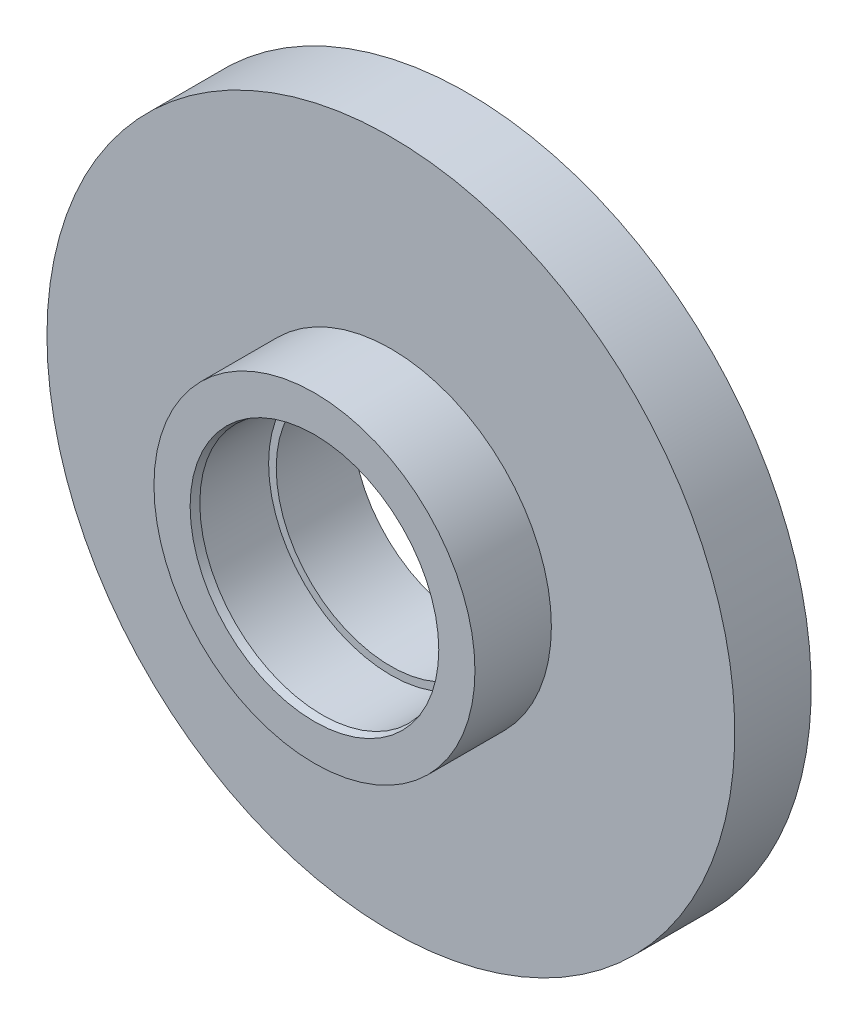
ISO-10303-21;
HEADER;
FILE_DESCRIPTION(('STEP AP214'),'2;1');
FILE_NAME('part.step','',(''),(''),'','','');
FILE_SCHEMA(('AUTOMOTIVE_DESIGN { 1 0 10303 214 1 1 1 1 }'));
ENDSEC;
DATA;
#1=APPLICATION_CONTEXT('core data for automotive mechanical design processes');
#2=APPLICATION_PROTOCOL_DEFINITION('international standard','automotive_design',2000,#1);
#3=PRODUCT_CONTEXT('',#1,'mechanical');
#4=PRODUCT('Part','Part','',(#3));
#5=PRODUCT_RELATED_PRODUCT_CATEGORY('part','',(#4));
#6=PRODUCT_DEFINITION_FORMATION('','',#4);
#7=PRODUCT_DEFINITION_CONTEXT('part definition',#1,'design');
#8=PRODUCT_DEFINITION('design','',#6,#7);
#9=PRODUCT_DEFINITION_SHAPE('','',#8);
#10=(LENGTH_UNIT() NAMED_UNIT(*) SI_UNIT(.MILLI.,.METRE.));
#11=(NAMED_UNIT(*) PLANE_ANGLE_UNIT() SI_UNIT($,.RADIAN.));
#12=(NAMED_UNIT(*) SI_UNIT($,.STERADIAN.) SOLID_ANGLE_UNIT());
#13=UNCERTAINTY_MEASURE_WITH_UNIT(LENGTH_MEASURE(1.E-05),#10,'distance_accuracy_value','');
#14=(GEOMETRIC_REPRESENTATION_CONTEXT(3) GLOBAL_UNCERTAINTY_ASSIGNED_CONTEXT((#13)) GLOBAL_UNIT_ASSIGNED_CONTEXT((#10,
#11,#12)) REPRESENTATION_CONTEXT('',''));
#15=CARTESIAN_POINT('',(0.,0.,0.));
#16=DIRECTION('',(0.,0.,1.));
#17=DIRECTION('',(1.,0.,0.));
#18=AXIS2_PLACEMENT_3D('',#15,#16,#17);
#19=CARTESIAN_POINT('',(16.,0.,0.));
#20=DIRECTION('',(0.,0.,-1.));
#21=DIRECTION('',(-1.,0.,0.));
#22=AXIS2_PLACEMENT_3D('',#19,#20,#21);
#23=PLANE('',#22);
#24=CARTESIAN_POINT('',(0.,0.,0.));
#25=DIRECTION('',(0.,0.,-1.));
#26=DIRECTION('',(-1.,0.,0.));
#27=AXIS2_PLACEMENT_3D('',#24,#25,#26);
#28=CIRCLE('',#27,16.2679491924312);
#29=CARTESIAN_POINT('',(-16.2679491924312,0.,0.));
#30=VERTEX_POINT('',#29);
#31=EDGE_CURVE('E37',#30,#30,#28,.T.);
#32=ORIENTED_EDGE('',*,*,#31,.T.);
#33=EDGE_LOOP('',(#32));
#34=FACE_BOUND('',#33,.T.);
#35=CARTESIAN_POINT('',(0.,0.,0.));
#36=DIRECTION('',(0.,0.,-1.));
#37=DIRECTION('',(-1.,0.,0.));
#38=AXIS2_PLACEMENT_3D('',#35,#36,#37);
#39=CIRCLE('',#38,21.);
#40=CARTESIAN_POINT('',(-21.,0.,0.));
#41=VERTEX_POINT('',#40);
#42=EDGE_CURVE('E41',#41,#41,#39,.T.);
#43=ORIENTED_EDGE('',*,*,#42,.F.);
#44=EDGE_LOOP('',(#43));
#45=FACE_BOUND('',#44,.T.);
#46=ADVANCED_FACE('F30',(#34,#45),#23,.F.);
#47=CARTESIAN_POINT('',(0.,0.,0.));
#48=DIRECTION('',(0.,0.,-1.));
#49=DIRECTION('',(-1.,0.,0.));
#50=AXIS2_PLACEMENT_3D('',#47,#48,#49);
#51=CYLINDRICAL_SURFACE('',#50,21.);
#52=CARTESIAN_POINT('',(0.,0.,-10.));
#53=DIRECTION('',(0.,0.,-1.));
#54=DIRECTION('',(-1.,0.,0.));
#55=AXIS2_PLACEMENT_3D('',#52,#53,#54);
#56=CIRCLE('',#55,21.);
#57=CARTESIAN_POINT('',(-21.,0.,-10.));
#58=VERTEX_POINT('',#57);
#59=EDGE_CURVE('E45',#58,#58,#56,.T.);
#60=ORIENTED_EDGE('',*,*,#59,.F.);
#61=EDGE_LOOP('',(#60));
#62=FACE_BOUND('',#61,.T.);
#63=ORIENTED_EDGE('',*,*,#42,.T.);
#64=EDGE_LOOP('',(#63));
#65=FACE_BOUND('',#64,.T.);
#66=ADVANCED_FACE('F95',(#62,#65),#51,.T.);
#67=CARTESIAN_POINT('',(21.,0.,-10.));
#68=DIRECTION('',(0.,0.,-1.));
#69=DIRECTION('',(-1.,0.,0.));
#70=AXIS2_PLACEMENT_3D('',#67,#68,#69);
#71=PLANE('',#70);
#72=CARTESIAN_POINT('',(0.,0.,-10.));
#73=DIRECTION('',(0.,0.,-1.));
#74=DIRECTION('',(-1.,0.,0.));
#75=AXIS2_PLACEMENT_3D('',#72,#73,#74);
#76=CIRCLE('',#75,45.);
#77=CARTESIAN_POINT('',(-45.,0.,-10.));
#78=VERTEX_POINT('',#77);
#79=EDGE_CURVE('E50',#78,#78,#76,.T.);
#80=ORIENTED_EDGE('',*,*,#79,.F.);
#81=EDGE_LOOP('',(#80));
#82=FACE_BOUND('',#81,.T.);
#83=ORIENTED_EDGE('',*,*,#59,.T.);
#84=EDGE_LOOP('',(#83));
#85=FACE_BOUND('',#84,.T.);
#86=ADVANCED_FACE('F89',(#82,#85),#71,.F.);
#87=CARTESIAN_POINT('',(0.,0.,0.));
#88=DIRECTION('',(0.,0.,-1.));
#89=DIRECTION('',(-1.,0.,0.));
#90=AXIS2_PLACEMENT_3D('',#87,#88,#89);
#91=CYLINDRICAL_SURFACE('',#90,45.);
#92=CARTESIAN_POINT('',(0.,0.,-20.));
#93=DIRECTION('',(0.,0.,-1.));
#94=DIRECTION('',(-1.,0.,0.));
#95=AXIS2_PLACEMENT_3D('',#92,#93,#94);
#96=CIRCLE('',#95,45.);
#97=CARTESIAN_POINT('',(-45.,0.,-20.));
#98=VERTEX_POINT('',#97);
#99=EDGE_CURVE('E53',#98,#98,#96,.T.);
#100=ORIENTED_EDGE('',*,*,#99,.F.);
#101=EDGE_LOOP('',(#100));
#102=FACE_BOUND('',#101,.T.);
#103=ORIENTED_EDGE('',*,*,#79,.T.);
#104=EDGE_LOOP('',(#103));
#105=FACE_BOUND('',#104,.T.);
#106=ADVANCED_FACE('F83',(#102,#105),#91,.T.);
#107=CARTESIAN_POINT('',(45.,0.,-20.));
#108=DIRECTION('',(0.,0.,1.));
#109=DIRECTION('',(1.,0.,0.));
#110=AXIS2_PLACEMENT_3D('',#107,#108,#109);
#111=PLANE('',#110);
#112=CARTESIAN_POINT('',(0.,0.,-20.));
#113=DIRECTION('',(0.,0.,-1.));
#114=DIRECTION('',(-1.,0.,0.));
#115=AXIS2_PLACEMENT_3D('',#112,#113,#114);
#116=CIRCLE('',#115,15.);
#117=CARTESIAN_POINT('',(-15.,0.,-20.));
#118=VERTEX_POINT('',#117);
#119=EDGE_CURVE('E56',#118,#118,#116,.T.);
#120=ORIENTED_EDGE('',*,*,#119,.F.);
#121=EDGE_LOOP('',(#120));
#122=FACE_BOUND('',#121,.T.);
#123=ORIENTED_EDGE('',*,*,#99,.T.);
#124=EDGE_LOOP('',(#123));
#125=FACE_BOUND('',#124,.T.);
#126=ADVANCED_FACE('F77',(#122,#125),#111,.F.);
#127=CARTESIAN_POINT('',(0.,0.,0.));
#128=DIRECTION('',(0.,0.,-1.));
#129=DIRECTION('',(-1.,0.,0.));
#130=AXIS2_PLACEMENT_3D('',#127,#128,#129);
#131=CYLINDRICAL_SURFACE('',#130,15.);
#132=CARTESIAN_POINT('',(0.,0.,-10.));
#133=DIRECTION('',(0.,0.,-1.));
#134=DIRECTION('',(-1.,0.,0.));
#135=AXIS2_PLACEMENT_3D('',#132,#133,#134);
#136=CIRCLE('',#135,15.);
#137=CARTESIAN_POINT('',(-15.,0.,-10.));
#138=VERTEX_POINT('',#137);
#139=EDGE_CURVE('E59',#138,#138,#136,.T.);
#140=ORIENTED_EDGE('',*,*,#139,.F.);
#141=EDGE_LOOP('',(#140));
#142=FACE_BOUND('',#141,.T.);
#143=ORIENTED_EDGE('',*,*,#119,.T.);
#144=EDGE_LOOP('',(#143));
#145=FACE_BOUND('',#144,.T.);
#146=ADVANCED_FACE('F71',(#142,#145),#131,.F.);
#147=CARTESIAN_POINT('',(16.,0.,-10.));
#148=DIRECTION('',(0.,0.,-1.));
#149=DIRECTION('',(-1.,0.,0.));
#150=AXIS2_PLACEMENT_3D('',#147,#148,#149);
#151=PLANE('',#150);
#152=CARTESIAN_POINT('',(0.,0.,-10.));
#153=DIRECTION('',(0.,0.,-1.));
#154=DIRECTION('',(-1.,0.,0.));
#155=AXIS2_PLACEMENT_3D('',#152,#153,#154);
#156=CIRCLE('',#155,16.);
#157=CARTESIAN_POINT('',(-16.,0.,-10.));
#158=VERTEX_POINT('',#157);
#159=EDGE_CURVE('E62',#158,#158,#156,.T.);
#160=ORIENTED_EDGE('',*,*,#159,.F.);
#161=EDGE_LOOP('',(#160));
#162=FACE_BOUND('',#161,.T.);
#163=ORIENTED_EDGE('',*,*,#139,.T.);
#164=EDGE_LOOP('',(#163));
#165=FACE_BOUND('',#164,.T.);
#166=ADVANCED_FACE('F68',(#162,#165),#151,.F.);
#167=CARTESIAN_POINT('',(0.,0.,0.));
#168=DIRECTION('',(0.,0.,-1.));
#169=DIRECTION('',(-1.,0.,0.));
#170=AXIS2_PLACEMENT_3D('',#167,#168,#169);
#171=CYLINDRICAL_SURFACE('',#170,16.);
#172=CARTESIAN_POINT('',(0.,0.,-1.00000000000013));
#173=DIRECTION('',(0.,0.,-1.));
#174=DIRECTION('',(-1.,0.,0.));
#175=AXIS2_PLACEMENT_3D('',#172,#173,#174);
#176=CIRCLE('',#175,16.);
#177=CARTESIAN_POINT('',(-16.,0.,-1.00000000000013));
#178=VERTEX_POINT('',#177);
#179=EDGE_CURVE('E10',#178,#178,#176,.F.);
#180=ORIENTED_EDGE('',*,*,#179,.T.);
#181=EDGE_LOOP('',(#180));
#182=FACE_BOUND('',#181,.T.);
#183=ORIENTED_EDGE('',*,*,#159,.T.);
#184=EDGE_LOOP('',(#183));
#185=FACE_BOUND('',#184,.T.);
#186=ADVANCED_FACE('F66',(#182,#185),#171,.F.);
#187=CARTESIAN_POINT('',(0.,0.,0.));
#188=DIRECTION('',(0.,0.,1.));
#189=DIRECTION('',(1.,0.,0.));
#190=AXIS2_PLACEMENT_3D('',#187,#188,#189);
#191=CONICAL_SURFACE('',#190,16.2679491924312,0.261799387799146);
#192=ORIENTED_EDGE('',*,*,#179,.F.);
#193=EDGE_LOOP('',(#192));
#194=FACE_BOUND('',#193,.T.);
#195=ORIENTED_EDGE('',*,*,#31,.F.);
#196=EDGE_LOOP('',(#195));
#197=FACE_BOUND('',#196,.T.);
#198=ADVANCED_FACE('F32',(#194,#197),#191,.F.);
#199=CLOSED_SHELL('',(#46,#66,#86,#106,#126,#146,#166,#186,#198));
#200=MANIFOLD_SOLID_BREP('B2',#199);
#201=ADVANCED_BREP_SHAPE_REPRESENTATION('',(#18,#200),#14);
#202=SHAPE_DEFINITION_REPRESENTATION(#9,#201);
ENDSEC;
END-ISO-10303-21;
